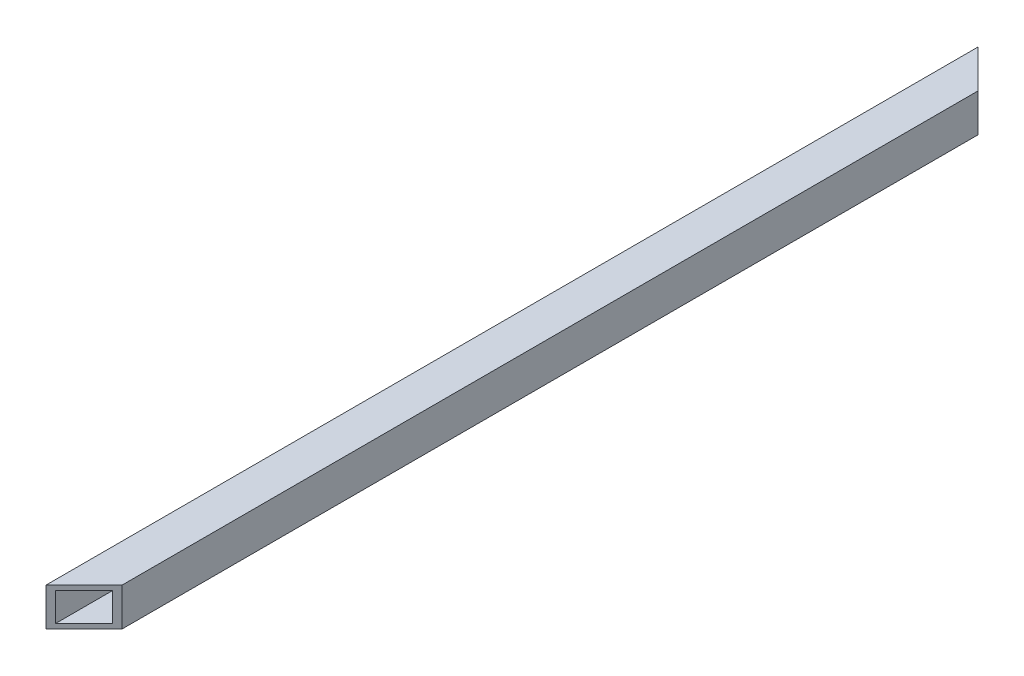
ISO-10303-21;
HEADER;
FILE_DESCRIPTION(('STEP AP214'),'2;1');
FILE_NAME('part.step','',(''),(''),'','','');
FILE_SCHEMA(('AUTOMOTIVE_DESIGN { 1 0 10303 214 1 1 1 1 }'));
ENDSEC;
DATA;
#1=APPLICATION_CONTEXT('core data for automotive mechanical design processes');
#2=APPLICATION_PROTOCOL_DEFINITION('international standard','automotive_design',2000,#1);
#3=PRODUCT_CONTEXT('',#1,'mechanical');
#4=PRODUCT('Part','Part','',(#3));
#5=PRODUCT_RELATED_PRODUCT_CATEGORY('part','',(#4));
#6=PRODUCT_DEFINITION_FORMATION('','',#4);
#7=PRODUCT_DEFINITION_CONTEXT('part definition',#1,'design');
#8=PRODUCT_DEFINITION('design','',#6,#7);
#9=PRODUCT_DEFINITION_SHAPE('','',#8);
#10=(LENGTH_UNIT() NAMED_UNIT(*) SI_UNIT(.MILLI.,.METRE.));
#11=(NAMED_UNIT(*) PLANE_ANGLE_UNIT() SI_UNIT($,.RADIAN.));
#12=(NAMED_UNIT(*) SI_UNIT($,.STERADIAN.) SOLID_ANGLE_UNIT());
#13=UNCERTAINTY_MEASURE_WITH_UNIT(LENGTH_MEASURE(1.E-05),#10,'distance_accuracy_value','');
#14=(GEOMETRIC_REPRESENTATION_CONTEXT(3) GLOBAL_UNCERTAINTY_ASSIGNED_CONTEXT((#13)) GLOBAL_UNIT_ASSIGNED_CONTEXT((#10,
#11,#12)) REPRESENTATION_CONTEXT('',''));
#15=CARTESIAN_POINT('',(0.,0.,0.));
#16=DIRECTION('',(0.,0.,1.));
#17=DIRECTION('',(1.,0.,0.));
#18=AXIS2_PLACEMENT_3D('',#15,#16,#17);
#19=CARTESIAN_POINT('',(-12.7,12.7,-311.15));
#20=DIRECTION('',(-0.70710678118655,0.,0.707106781186545));
#21=DIRECTION('',(0.707106781186545,0.,0.70710678118655));
#22=AXIS2_PLACEMENT_3D('',#19,#20,#21);
#23=PLANE('',#22);
#24=DIRECTION('',(0.707106781186545,0.,0.70710678118655));
#25=VECTOR('',#24,1.);
#26=CARTESIAN_POINT('',(71.4375,-12.7,-227.0125));
#27=LINE('',#26,#25);
#28=CARTESIAN_POINT('',(-12.7,-12.7,-311.15));
#29=VERTEX_POINT('',#28);
#30=CARTESIAN_POINT('',(12.7,-12.7,-285.75));
#31=VERTEX_POINT('',#30);
#32=EDGE_CURVE('E9',#29,#31,#27,.T.);
#33=ORIENTED_EDGE('',*,*,#32,.F.);
#34=DIRECTION('',(0.,-1.,0.));
#35=VECTOR('',#34,1.);
#36=CARTESIAN_POINT('',(-12.7,-12.7,-311.15));
#37=LINE('',#36,#35);
#38=CARTESIAN_POINT('',(-12.7,12.7,-311.15));
#39=VERTEX_POINT('',#38);
#40=EDGE_CURVE('E34',#39,#29,#37,.T.);
#41=ORIENTED_EDGE('',*,*,#40,.F.);
#42=DIRECTION('',(-0.707106781186545,0.,-0.70710678118655));
#43=VECTOR('',#42,1.);
#44=CARTESIAN_POINT('',(65.0875,12.7,-233.362499999999));
#45=LINE('',#44,#43);
#46=CARTESIAN_POINT('',(12.6999999999998,12.7,-285.75));
#47=VERTEX_POINT('',#46);
#48=EDGE_CURVE('E129',#47,#39,#45,.T.);
#49=ORIENTED_EDGE('',*,*,#48,.F.);
#50=DIRECTION('',(0.,1.,0.));
#51=VECTOR('',#50,1.);
#52=CARTESIAN_POINT('',(12.7,12.7,-285.75));
#53=LINE('',#52,#51);
#54=EDGE_CURVE('E113',#31,#47,#53,.T.);
#55=ORIENTED_EDGE('',*,*,#54,.F.);
#56=EDGE_LOOP('',(#33,#41,#49,#55));
#57=FACE_BOUND('',#56,.T.);
#58=DIRECTION('',(0.,-1.,0.));
#59=VECTOR('',#58,1.);
#60=CARTESIAN_POINT('',(9.52500000000001,11.1125,-288.925));
#61=LINE('',#60,#59);
#62=CARTESIAN_POINT('',(9.525,9.525,-288.925));
#63=VERTEX_POINT('',#62);
#64=CARTESIAN_POINT('',(9.525,-9.525,-288.925));
#65=VERTEX_POINT('',#64);
#66=EDGE_CURVE('E91',#63,#65,#61,.T.);
#67=ORIENTED_EDGE('',*,*,#66,.F.);
#68=DIRECTION('',(0.707106781186545,0.,0.70710678118655));
#69=VECTOR('',#68,1.);
#70=CARTESIAN_POINT('',(65.88125,9.525,-232.56875));
#71=LINE('',#70,#69);
#72=CARTESIAN_POINT('',(-9.525,9.525,-307.975));
#73=VERTEX_POINT('',#72);
#74=EDGE_CURVE('E99',#73,#63,#71,.T.);
#75=ORIENTED_EDGE('',*,*,#74,.F.);
#76=DIRECTION('',(0.,1.,0.));
#77=VECTOR('',#76,1.);
#78=CARTESIAN_POINT('',(-9.52500000000001,1.5875,-307.975));
#79=LINE('',#78,#77);
#80=CARTESIAN_POINT('',(-9.525,-9.525,-307.975));
#81=VERTEX_POINT('',#80);
#82=EDGE_CURVE('E100',#81,#73,#79,.T.);
#83=ORIENTED_EDGE('',*,*,#82,.F.);
#84=DIRECTION('',(-0.707106781186545,0.,-0.70710678118655));
#85=VECTOR('',#84,1.);
#86=CARTESIAN_POINT('',(70.64375,-9.525,-227.80625));
#87=LINE('',#86,#85);
#88=EDGE_CURVE('E110',#65,#81,#87,.T.);
#89=ORIENTED_EDGE('',*,*,#88,.F.);
#90=EDGE_LOOP('',(#67,#75,#83,#89));
#91=FACE_BOUND('',#90,.T.);
#92=ADVANCED_FACE('F15',(#57,#91),#23,.F.);
#93=CARTESIAN_POINT('',(12.7,12.7,285.75));
#94=DIRECTION('',(-0.707106781186548,0.,-0.707106781186547));
#95=DIRECTION('',(-0.707106781186547,0.,0.707106781186548));
#96=AXIS2_PLACEMENT_3D('',#93,#94,#95);
#97=PLANE('',#96);
#98=DIRECTION('',(-0.707106781186547,0.,0.707106781186548));
#99=VECTOR('',#98,1.);
#100=CARTESIAN_POINT('',(84.1375,-12.7,214.3125));
#101=LINE('',#100,#99);
#102=CARTESIAN_POINT('',(12.7,-12.7,285.75));
#103=VERTEX_POINT('',#102);
#104=CARTESIAN_POINT('',(-12.7,-12.7,311.15));
#105=VERTEX_POINT('',#104);
#106=EDGE_CURVE('E25',#103,#105,#101,.T.);
#107=ORIENTED_EDGE('',*,*,#106,.F.);
#108=DIRECTION('',(0.,-1.,0.));
#109=VECTOR('',#108,1.);
#110=CARTESIAN_POINT('',(12.7,12.7,285.75));
#111=LINE('',#110,#109);
#112=CARTESIAN_POINT('',(12.7,12.7,285.75));
#113=VERTEX_POINT('',#112);
#114=EDGE_CURVE('E116',#113,#103,#111,.T.);
#115=ORIENTED_EDGE('',*,*,#114,.F.);
#116=DIRECTION('',(0.707106781186547,0.,-0.707106781186548));
#117=VECTOR('',#116,1.);
#118=CARTESIAN_POINT('',(77.7875,12.7,220.6625));
#119=LINE('',#118,#117);
#120=CARTESIAN_POINT('',(-12.7,12.7,311.15));
#121=VERTEX_POINT('',#120);
#122=EDGE_CURVE('E132',#121,#113,#119,.T.);
#123=ORIENTED_EDGE('',*,*,#122,.F.);
#124=DIRECTION('',(0.,1.,0.));
#125=VECTOR('',#124,1.);
#126=CARTESIAN_POINT('',(-12.7,-12.7,311.15));
#127=LINE('',#126,#125);
#128=EDGE_CURVE('E125',#105,#121,#127,.T.);
#129=ORIENTED_EDGE('',*,*,#128,.F.);
#130=EDGE_LOOP('',(#107,#115,#123,#129));
#131=FACE_BOUND('',#130,.T.);
#132=DIRECTION('',(0.,1.,0.));
#133=VECTOR('',#132,1.);
#134=CARTESIAN_POINT('',(9.52500000000001,11.1125,288.925));
#135=LINE('',#134,#133);
#136=CARTESIAN_POINT('',(9.525,-9.525,288.925));
#137=VERTEX_POINT('',#136);
#138=CARTESIAN_POINT('',(9.525,9.525,288.925));
#139=VERTEX_POINT('',#138);
#140=EDGE_CURVE('E119',#137,#139,#135,.T.);
#141=ORIENTED_EDGE('',*,*,#140,.F.);
#142=DIRECTION('',(0.707106781186547,0.,-0.707106781186548));
#143=VECTOR('',#142,1.);
#144=CARTESIAN_POINT('',(83.34375,-9.525,215.10625));
#145=LINE('',#144,#143);
#146=CARTESIAN_POINT('',(-9.525,-9.525,307.975));
#147=VERTEX_POINT('',#146);
#148=EDGE_CURVE('E78',#147,#137,#145,.T.);
#149=ORIENTED_EDGE('',*,*,#148,.F.);
#150=DIRECTION('',(0.,-1.,0.));
#151=VECTOR('',#150,1.);
#152=CARTESIAN_POINT('',(-9.52499999999998,1.5875,307.975));
#153=LINE('',#152,#151);
#154=CARTESIAN_POINT('',(-9.525,9.525,307.975));
#155=VERTEX_POINT('',#154);
#156=EDGE_CURVE('E81',#155,#147,#153,.T.);
#157=ORIENTED_EDGE('',*,*,#156,.F.);
#158=DIRECTION('',(-0.707106781186547,0.,0.707106781186548));
#159=VECTOR('',#158,1.);
#160=CARTESIAN_POINT('',(78.58125,9.525,219.86875));
#161=LINE('',#160,#159);
#162=EDGE_CURVE('E84',#139,#155,#161,.T.);
#163=ORIENTED_EDGE('',*,*,#162,.F.);
#164=EDGE_LOOP('',(#141,#149,#157,#163));
#165=FACE_BOUND('',#164,.T.);
#166=ADVANCED_FACE('F83',(#131,#165),#97,.F.);
#167=CARTESIAN_POINT('',(12.7,-12.7,0.));
#168=DIRECTION('',(0.,-1.,0.));
#169=DIRECTION('',(0.,0.,-1.));
#170=AXIS2_PLACEMENT_3D('',#167,#168,#169);
#171=PLANE('',#170);
#172=ORIENTED_EDGE('',*,*,#32,.T.);
#173=DIRECTION('',(0.,0.,-1.));
#174=VECTOR('',#173,1.);
#175=CARTESIAN_POINT('',(12.7,-12.7,0.));
#176=LINE('',#175,#174);
#177=EDGE_CURVE('E122',#103,#31,#176,.T.);
#178=ORIENTED_EDGE('',*,*,#177,.F.);
#179=ORIENTED_EDGE('',*,*,#106,.T.);
#180=DIRECTION('',(0.,0.,-1.));
#181=VECTOR('',#180,1.);
#182=CARTESIAN_POINT('',(-12.7,-12.7,0.));
#183=LINE('',#182,#181);
#184=EDGE_CURVE('E126',#105,#29,#183,.T.);
#185=ORIENTED_EDGE('',*,*,#184,.T.);
#186=EDGE_LOOP('',(#172,#178,#179,#185));
#187=FACE_BOUND('',#186,.T.);
#188=ADVANCED_FACE('F164',(#187),#171,.T.);
#189=CARTESIAN_POINT('',(-12.7,12.7,0.));
#190=DIRECTION('',(0.,1.,0.));
#191=DIRECTION('',(0.,0.,1.));
#192=AXIS2_PLACEMENT_3D('',#189,#190,#191);
#193=PLANE('',#192);
#194=ORIENTED_EDGE('',*,*,#48,.T.);
#195=DIRECTION('',(0.,0.,1.));
#196=VECTOR('',#195,1.);
#197=CARTESIAN_POINT('',(-12.7,12.7,0.));
#198=LINE('',#197,#196);
#199=EDGE_CURVE('E130',#39,#121,#198,.T.);
#200=ORIENTED_EDGE('',*,*,#199,.T.);
#201=ORIENTED_EDGE('',*,*,#122,.T.);
#202=DIRECTION('',(0.,0.,-1.));
#203=VECTOR('',#202,1.);
#204=CARTESIAN_POINT('',(12.7,12.7,0.));
#205=LINE('',#204,#203);
#206=EDGE_CURVE('E133',#113,#47,#205,.T.);
#207=ORIENTED_EDGE('',*,*,#206,.T.);
#208=EDGE_LOOP('',(#194,#200,#201,#207));
#209=FACE_BOUND('',#208,.T.);
#210=ADVANCED_FACE('F149',(#209),#193,.T.);
#211=CARTESIAN_POINT('',(-9.525,9.525,0.));
#212=DIRECTION('',(0.,1.,0.));
#213=DIRECTION('',(0.,0.,1.));
#214=AXIS2_PLACEMENT_3D('',#211,#212,#213);
#215=PLANE('',#214);
#216=ORIENTED_EDGE('',*,*,#74,.T.);
#217=DIRECTION('',(0.,0.,-1.));
#218=VECTOR('',#217,1.);
#219=CARTESIAN_POINT('',(9.525,9.525,0.));
#220=LINE('',#219,#218);
#221=EDGE_CURVE('E98',#139,#63,#220,.T.);
#222=ORIENTED_EDGE('',*,*,#221,.F.);
#223=ORIENTED_EDGE('',*,*,#162,.T.);
#224=DIRECTION('',(0.,0.,1.));
#225=VECTOR('',#224,1.);
#226=CARTESIAN_POINT('',(-9.525,9.525,0.));
#227=LINE('',#226,#225);
#228=EDGE_CURVE('E90',#73,#155,#227,.T.);
#229=ORIENTED_EDGE('',*,*,#228,.F.);
#230=EDGE_LOOP('',(#216,#222,#223,#229));
#231=FACE_BOUND('',#230,.T.);
#232=ADVANCED_FACE('F96',(#231),#215,.F.);
#233=CARTESIAN_POINT('',(-9.525,-9.525,0.));
#234=DIRECTION('',(-1.,0.,0.));
#235=DIRECTION('',(0.,0.,1.));
#236=AXIS2_PLACEMENT_3D('',#233,#234,#235);
#237=PLANE('',#236);
#238=ORIENTED_EDGE('',*,*,#82,.T.);
#239=ORIENTED_EDGE('',*,*,#228,.T.);
#240=ORIENTED_EDGE('',*,*,#156,.T.);
#241=DIRECTION('',(0.,0.,1.));
#242=VECTOR('',#241,1.);
#243=CARTESIAN_POINT('',(-9.525,-9.525,0.));
#244=LINE('',#243,#242);
#245=EDGE_CURVE('E109',#81,#147,#244,.T.);
#246=ORIENTED_EDGE('',*,*,#245,.F.);
#247=EDGE_LOOP('',(#238,#239,#240,#246));
#248=FACE_BOUND('',#247,.T.);
#249=ADVANCED_FACE('F102',(#248),#237,.F.);
#250=CARTESIAN_POINT('',(9.525,9.525,0.));
#251=DIRECTION('',(1.,0.,0.));
#252=DIRECTION('',(0.,0.,-1.));
#253=AXIS2_PLACEMENT_3D('',#250,#251,#252);
#254=PLANE('',#253);
#255=ORIENTED_EDGE('',*,*,#66,.T.);
#256=DIRECTION('',(0.,0.,1.));
#257=VECTOR('',#256,1.);
#258=CARTESIAN_POINT('',(9.525,-9.525,0.));
#259=LINE('',#258,#257);
#260=EDGE_CURVE('E19',#65,#137,#259,.T.);
#261=ORIENTED_EDGE('',*,*,#260,.T.);
#262=ORIENTED_EDGE('',*,*,#140,.T.);
#263=ORIENTED_EDGE('',*,*,#221,.T.);
#264=EDGE_LOOP('',(#255,#261,#262,#263));
#265=FACE_BOUND('',#264,.T.);
#266=ADVANCED_FACE('F178',(#265),#254,.F.);
#267=CARTESIAN_POINT('',(9.525,-9.525,0.));
#268=DIRECTION('',(0.,-1.,0.));
#269=DIRECTION('',(0.,0.,-1.));
#270=AXIS2_PLACEMENT_3D('',#267,#268,#269);
#271=PLANE('',#270);
#272=ORIENTED_EDGE('',*,*,#88,.T.);
#273=ORIENTED_EDGE('',*,*,#245,.T.);
#274=ORIENTED_EDGE('',*,*,#148,.T.);
#275=ORIENTED_EDGE('',*,*,#260,.F.);
#276=EDGE_LOOP('',(#272,#273,#274,#275));
#277=FACE_BOUND('',#276,.T.);
#278=ADVANCED_FACE('F157',(#277),#271,.F.);
#279=CARTESIAN_POINT('',(12.7,12.7,0.));
#280=DIRECTION('',(1.,0.,0.));
#281=DIRECTION('',(0.,0.,-1.));
#282=AXIS2_PLACEMENT_3D('',#279,#280,#281);
#283=PLANE('',#282);
#284=ORIENTED_EDGE('',*,*,#54,.T.);
#285=ORIENTED_EDGE('',*,*,#206,.F.);
#286=ORIENTED_EDGE('',*,*,#114,.T.);
#287=ORIENTED_EDGE('',*,*,#177,.T.);
#288=EDGE_LOOP('',(#284,#285,#286,#287));
#289=FACE_BOUND('',#288,.T.);
#290=ADVANCED_FACE('F152',(#289),#283,.T.);
#291=CARTESIAN_POINT('',(-12.7,-12.7,0.));
#292=DIRECTION('',(-1.,0.,0.));
#293=DIRECTION('',(0.,0.,1.));
#294=AXIS2_PLACEMENT_3D('',#291,#292,#293);
#295=PLANE('',#294);
#296=ORIENTED_EDGE('',*,*,#128,.T.);
#297=ORIENTED_EDGE('',*,*,#199,.F.);
#298=ORIENTED_EDGE('',*,*,#40,.T.);
#299=ORIENTED_EDGE('',*,*,#184,.F.);
#300=EDGE_LOOP('',(#296,#297,#298,#299));
#301=FACE_BOUND('',#300,.T.);
#302=ADVANCED_FACE('F17',(#301),#295,.T.);
#303=CLOSED_SHELL('',(#92,#166,#188,#210,#232,#249,#266,#278,#290,#302));
#304=MANIFOLD_SOLID_BREP('B1',#303);
#305=ADVANCED_BREP_SHAPE_REPRESENTATION('',(#18,#304),#14);
#306=SHAPE_DEFINITION_REPRESENTATION(#9,#305);
ENDSEC;
END-ISO-10303-21;
